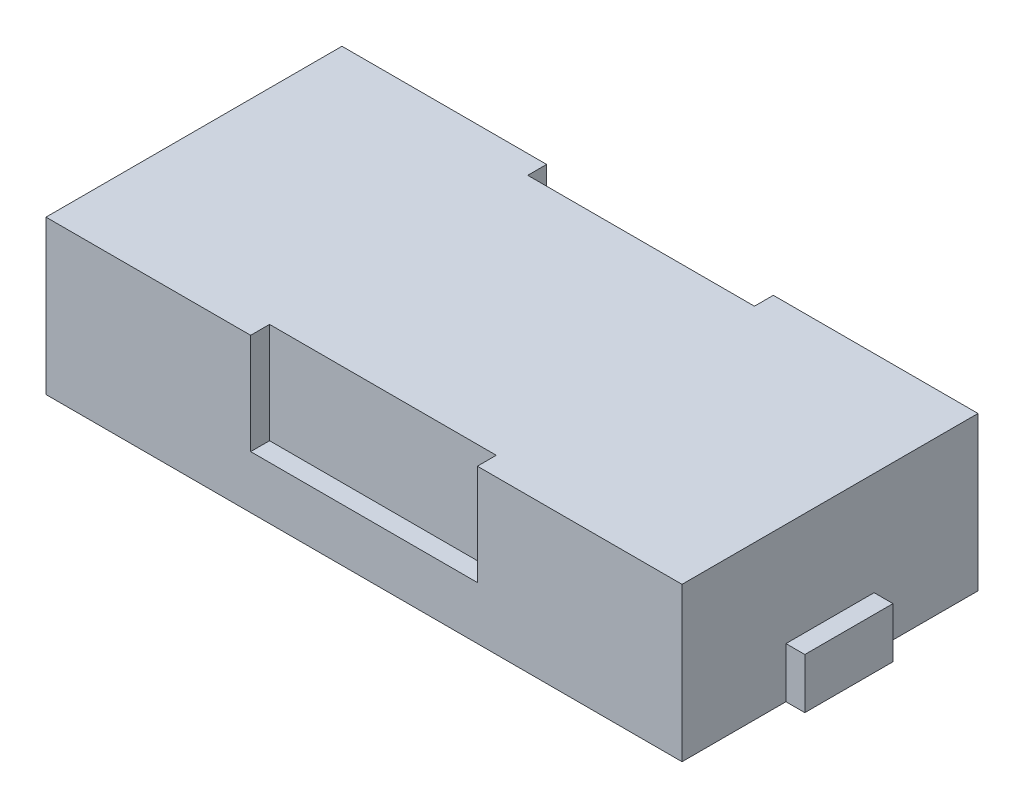
ISO-10303-21;
HEADER;
FILE_DESCRIPTION(('STEP AP214'),'2;1');
FILE_NAME('part.step','',(''),(''),'','','');
FILE_SCHEMA(('AUTOMOTIVE_DESIGN { 1 0 10303 214 1 1 1 1 }'));
ENDSEC;
DATA;
#1=APPLICATION_CONTEXT('core data for automotive mechanical design processes');
#2=APPLICATION_PROTOCOL_DEFINITION('international standard','automotive_design',2000,#1);
#3=PRODUCT_CONTEXT('',#1,'mechanical');
#4=PRODUCT('Part','Part','',(#3));
#5=PRODUCT_RELATED_PRODUCT_CATEGORY('part','',(#4));
#6=PRODUCT_DEFINITION_FORMATION('','',#4);
#7=PRODUCT_DEFINITION_CONTEXT('part definition',#1,'design');
#8=PRODUCT_DEFINITION('design','',#6,#7);
#9=PRODUCT_DEFINITION_SHAPE('','',#8);
#10=(LENGTH_UNIT() NAMED_UNIT(*) SI_UNIT(.MILLI.,.METRE.));
#11=(NAMED_UNIT(*) PLANE_ANGLE_UNIT() SI_UNIT($,.RADIAN.));
#12=(NAMED_UNIT(*) SI_UNIT($,.STERADIAN.) SOLID_ANGLE_UNIT());
#13=UNCERTAINTY_MEASURE_WITH_UNIT(LENGTH_MEASURE(1.E-05),#10,'distance_accuracy_value','');
#14=(GEOMETRIC_REPRESENTATION_CONTEXT(3) GLOBAL_UNCERTAINTY_ASSIGNED_CONTEXT((#13)) GLOBAL_UNIT_ASSIGNED_CONTEXT((#10,
#11,#12)) REPRESENTATION_CONTEXT('',''));
#15=CARTESIAN_POINT('',(0.,0.,0.));
#16=DIRECTION('',(0.,0.,1.));
#17=DIRECTION('',(1.,0.,0.));
#18=AXIS2_PLACEMENT_3D('',#15,#16,#17);
#19=CARTESIAN_POINT('',(-25.25,12.2,-11.75));
#20=DIRECTION('',(0.,0.,1.));
#21=DIRECTION('',(1.,0.,0.));
#22=AXIS2_PLACEMENT_3D('',#19,#20,#21);
#23=PLANE('',#22);
#24=DIRECTION('',(0.,-1.,0.));
#25=VECTOR('',#24,1.);
#26=CARTESIAN_POINT('',(-9.,12.2,-11.75));
#27=LINE('',#26,#25);
#28=CARTESIAN_POINT('',(-9.,12.2,-11.75));
#29=VERTEX_POINT('',#28);
#30=CARTESIAN_POINT('',(-9.,4.2,-11.75));
#31=VERTEX_POINT('',#30);
#32=EDGE_CURVE('E293',#29,#31,#27,.T.);
#33=ORIENTED_EDGE('',*,*,#32,.T.);
#34=DIRECTION('',(1.,0.,0.));
#35=VECTOR('',#34,1.);
#36=CARTESIAN_POINT('',(-9.,4.2,-11.75));
#37=LINE('',#36,#35);
#38=CARTESIAN_POINT('',(9.,4.2,-11.75));
#39=VERTEX_POINT('',#38);
#40=EDGE_CURVE('E294',#31,#39,#37,.T.);
#41=ORIENTED_EDGE('',*,*,#40,.T.);
#42=DIRECTION('',(0.,1.,0.));
#43=VECTOR('',#42,1.);
#44=CARTESIAN_POINT('',(9.,12.2,-11.75));
#45=LINE('',#44,#43);
#46=CARTESIAN_POINT('',(9.,12.2,-11.75));
#47=VERTEX_POINT('',#46);
#48=EDGE_CURVE('E297',#39,#47,#45,.T.);
#49=ORIENTED_EDGE('',*,*,#48,.T.);
#50=DIRECTION('',(-1.,0.,0.));
#51=VECTOR('',#50,1.);
#52=CARTESIAN_POINT('',(-25.25,12.2,-11.75));
#53=LINE('',#52,#51);
#54=CARTESIAN_POINT('',(25.25,12.2,-11.75));
#55=VERTEX_POINT('',#54);
#56=EDGE_CURVE('E169',#55,#47,#53,.T.);
#57=ORIENTED_EDGE('',*,*,#56,.F.);
#58=DIRECTION('',(0.,-1.,0.));
#59=VECTOR('',#58,1.);
#60=CARTESIAN_POINT('',(25.25,12.2,-11.75));
#61=LINE('',#60,#59);
#62=CARTESIAN_POINT('',(25.25,0.,-11.75));
#63=VERTEX_POINT('',#62);
#64=EDGE_CURVE('E11',#55,#63,#61,.T.);
#65=ORIENTED_EDGE('',*,*,#64,.T.);
#66=DIRECTION('',(-1.,0.,0.));
#67=VECTOR('',#66,1.);
#68=CARTESIAN_POINT('',(-25.25,0.,-11.75));
#69=LINE('',#68,#67);
#70=CARTESIAN_POINT('',(-25.25,0.,-11.75));
#71=VERTEX_POINT('',#70);
#72=EDGE_CURVE('E247',#63,#71,#69,.T.);
#73=ORIENTED_EDGE('',*,*,#72,.T.);
#74=DIRECTION('',(0.,-1.,0.));
#75=VECTOR('',#74,1.);
#76=CARTESIAN_POINT('',(-25.25,12.2,-11.75));
#77=LINE('',#76,#75);
#78=CARTESIAN_POINT('',(-25.25,12.2,-11.75));
#79=VERTEX_POINT('',#78);
#80=EDGE_CURVE('E43',#79,#71,#77,.T.);
#81=ORIENTED_EDGE('',*,*,#80,.F.);
#82=EDGE_CURVE('E235',#29,#79,#53,.T.);
#83=ORIENTED_EDGE('',*,*,#82,.F.);
#84=EDGE_LOOP('',(#33,#41,#49,#57,#65,#73,#81,#83));
#85=FACE_BOUND('',#84,.T.);
#86=ADVANCED_FACE('F35',(#85),#23,.F.);
#87=CARTESIAN_POINT('',(0.,12.2,0.));
#88=DIRECTION('',(0.,-1.,0.));
#89=DIRECTION('',(0.,0.,-1.));
#90=AXIS2_PLACEMENT_3D('',#87,#88,#89);
#91=PLANE('',#90);
#92=DIRECTION('',(0.,0.,-1.));
#93=VECTOR('',#92,1.);
#94=CARTESIAN_POINT('',(-9.,12.2,-10.25));
#95=LINE('',#94,#93);
#96=CARTESIAN_POINT('',(-9.,12.2,-10.25));
#97=VERTEX_POINT('',#96);
#98=EDGE_CURVE('E170',#97,#29,#95,.T.);
#99=ORIENTED_EDGE('',*,*,#98,.T.);
#100=ORIENTED_EDGE('',*,*,#82,.T.);
#101=DIRECTION('',(0.,0.,1.));
#102=VECTOR('',#101,1.);
#103=CARTESIAN_POINT('',(-25.25,12.2,11.75));
#104=LINE('',#103,#102);
#105=CARTESIAN_POINT('',(-25.25,12.2,11.75));
#106=VERTEX_POINT('',#105);
#107=EDGE_CURVE('E238',#79,#106,#104,.T.);
#108=ORIENTED_EDGE('',*,*,#107,.T.);
#109=DIRECTION('',(1.,0.,0.));
#110=VECTOR('',#109,1.);
#111=CARTESIAN_POINT('',(-25.25,12.2,11.75));
#112=LINE('',#111,#110);
#113=CARTESIAN_POINT('',(-9.,12.2,11.75));
#114=VERTEX_POINT('',#113);
#115=EDGE_CURVE('E241',#106,#114,#112,.T.);
#116=ORIENTED_EDGE('',*,*,#115,.T.);
#117=DIRECTION('',(0.,0.,1.));
#118=VECTOR('',#117,1.);
#119=CARTESIAN_POINT('',(-9.,12.2,10.25));
#120=LINE('',#119,#118);
#121=CARTESIAN_POINT('',(-9.,12.2,10.25));
#122=VERTEX_POINT('',#121);
#123=EDGE_CURVE('E194',#122,#114,#120,.T.);
#124=ORIENTED_EDGE('',*,*,#123,.F.);
#125=DIRECTION('',(-1.,0.,0.));
#126=VECTOR('',#125,1.);
#127=CARTESIAN_POINT('',(-9.,12.2,10.25));
#128=LINE('',#127,#126);
#129=CARTESIAN_POINT('',(9.,12.2,10.25));
#130=VERTEX_POINT('',#129);
#131=EDGE_CURVE('E184',#130,#122,#128,.T.);
#132=ORIENTED_EDGE('',*,*,#131,.F.);
#133=DIRECTION('',(0.,0.,1.));
#134=VECTOR('',#133,1.);
#135=CARTESIAN_POINT('',(9.,12.2,10.25));
#136=LINE('',#135,#134);
#137=CARTESIAN_POINT('',(9.,12.2,11.75));
#138=VERTEX_POINT('',#137);
#139=EDGE_CURVE('E197',#130,#138,#136,.T.);
#140=ORIENTED_EDGE('',*,*,#139,.T.);
#141=CARTESIAN_POINT('',(25.25,12.2,11.75));
#142=VERTEX_POINT('',#141);
#143=EDGE_CURVE('E240',#138,#142,#112,.T.);
#144=ORIENTED_EDGE('',*,*,#143,.T.);
#145=DIRECTION('',(0.,0.,-1.));
#146=VECTOR('',#145,1.);
#147=CARTESIAN_POINT('',(25.25,12.2,11.75));
#148=LINE('',#147,#146);
#149=EDGE_CURVE('E233',#142,#55,#148,.T.);
#150=ORIENTED_EDGE('',*,*,#149,.T.);
#151=ORIENTED_EDGE('',*,*,#56,.T.);
#152=DIRECTION('',(0.,0.,-1.));
#153=VECTOR('',#152,1.);
#154=CARTESIAN_POINT('',(9.,12.2,-10.25));
#155=LINE('',#154,#153);
#156=CARTESIAN_POINT('',(9.,12.2,-10.25));
#157=VERTEX_POINT('',#156);
#158=EDGE_CURVE('E155',#157,#47,#155,.T.);
#159=ORIENTED_EDGE('',*,*,#158,.F.);
#160=DIRECTION('',(-1.,0.,0.));
#161=VECTOR('',#160,1.);
#162=CARTESIAN_POINT('',(-9.,12.2,-10.25));
#163=LINE('',#162,#161);
#164=EDGE_CURVE('E159',#157,#97,#163,.T.);
#165=ORIENTED_EDGE('',*,*,#164,.T.);
#166=EDGE_LOOP('',(#99,#100,#108,#116,#124,#132,#140,#144,#150,#151,#159,#165));
#167=FACE_BOUND('',#166,.T.);
#168=ADVANCED_FACE('F167',(#167),#91,.F.);
#169=CARTESIAN_POINT('',(25.25,12.2,11.75));
#170=DIRECTION('',(-1.,0.,0.));
#171=DIRECTION('',(0.,0.,1.));
#172=AXIS2_PLACEMENT_3D('',#169,#170,#171);
#173=PLANE('',#172);
#174=DIRECTION('',(0.,-1.,0.));
#175=VECTOR('',#174,1.);
#176=CARTESIAN_POINT('',(25.25,0.,3.5));
#177=LINE('',#176,#175);
#178=CARTESIAN_POINT('',(25.25,4.,3.5));
#179=VERTEX_POINT('',#178);
#180=CARTESIAN_POINT('',(25.25,0.,3.5));
#181=VERTEX_POINT('',#180);
#182=EDGE_CURVE('E196',#179,#181,#177,.T.);
#183=ORIENTED_EDGE('',*,*,#182,.F.);
#184=DIRECTION('',(0.,0.,1.));
#185=VECTOR('',#184,1.);
#186=CARTESIAN_POINT('',(25.25,4.,3.5));
#187=LINE('',#186,#185);
#188=CARTESIAN_POINT('',(25.25,4.,-3.5));
#189=VERTEX_POINT('',#188);
#190=EDGE_CURVE('E207',#189,#179,#187,.T.);
#191=ORIENTED_EDGE('',*,*,#190,.F.);
#192=DIRECTION('',(0.,1.,0.));
#193=VECTOR('',#192,1.);
#194=CARTESIAN_POINT('',(25.25,0.,-3.5));
#195=LINE('',#194,#193);
#196=CARTESIAN_POINT('',(25.25,0.,-3.5));
#197=VERTEX_POINT('',#196);
#198=EDGE_CURVE('E216',#197,#189,#195,.T.);
#199=ORIENTED_EDGE('',*,*,#198,.F.);
#200=DIRECTION('',(0.,0.,-1.));
#201=VECTOR('',#200,1.);
#202=CARTESIAN_POINT('',(25.25,0.,11.75));
#203=LINE('',#202,#201);
#204=EDGE_CURVE('E232',#197,#63,#203,.T.);
#205=ORIENTED_EDGE('',*,*,#204,.T.);
#206=ORIENTED_EDGE('',*,*,#64,.F.);
#207=ORIENTED_EDGE('',*,*,#149,.F.);
#208=DIRECTION('',(0.,-1.,0.));
#209=VECTOR('',#208,1.);
#210=CARTESIAN_POINT('',(25.25,12.2,11.75));
#211=LINE('',#210,#209);
#212=CARTESIAN_POINT('',(25.25,0.,11.75));
#213=VERTEX_POINT('',#212);
#214=EDGE_CURVE('E244',#142,#213,#211,.T.);
#215=ORIENTED_EDGE('',*,*,#214,.T.);
#216=EDGE_CURVE('E245',#213,#181,#203,.T.);
#217=ORIENTED_EDGE('',*,*,#216,.T.);
#218=EDGE_LOOP('',(#183,#191,#199,#205,#206,#207,#215,#217));
#219=FACE_BOUND('',#218,.T.);
#220=ADVANCED_FACE('F37',(#219),#173,.F.);
#221=CARTESIAN_POINT('',(-25.25,12.2,11.75));
#222=DIRECTION('',(1.,0.,0.));
#223=DIRECTION('',(0.,0.,-1.));
#224=AXIS2_PLACEMENT_3D('',#221,#222,#223);
#225=PLANE('',#224);
#226=DIRECTION('',(0.,0.,1.));
#227=VECTOR('',#226,1.);
#228=CARTESIAN_POINT('',(-25.25,0.,11.75));
#229=LINE('',#228,#227);
#230=CARTESIAN_POINT('',(-25.25,0.,11.75));
#231=VERTEX_POINT('',#230);
#232=EDGE_CURVE('E249',#71,#231,#229,.T.);
#233=ORIENTED_EDGE('',*,*,#232,.T.);
#234=DIRECTION('',(0.,-1.,0.));
#235=VECTOR('',#234,1.);
#236=CARTESIAN_POINT('',(-25.25,12.2,11.75));
#237=LINE('',#236,#235);
#238=EDGE_CURVE('E254',#106,#231,#237,.T.);
#239=ORIENTED_EDGE('',*,*,#238,.F.);
#240=ORIENTED_EDGE('',*,*,#107,.F.);
#241=ORIENTED_EDGE('',*,*,#80,.T.);
#242=EDGE_LOOP('',(#233,#239,#240,#241));
#243=FACE_BOUND('',#242,.T.);
#244=ADVANCED_FACE('F261',(#243),#225,.F.);
#245=CARTESIAN_POINT('',(-25.25,12.2,11.75));
#246=DIRECTION('',(0.,0.,-1.));
#247=DIRECTION('',(-1.,0.,0.));
#248=AXIS2_PLACEMENT_3D('',#245,#246,#247);
#249=PLANE('',#248);
#250=DIRECTION('',(1.,0.,0.));
#251=VECTOR('',#250,1.);
#252=CARTESIAN_POINT('',(-9.,4.2,11.75));
#253=LINE('',#252,#251);
#254=CARTESIAN_POINT('',(-9.,4.2,11.75));
#255=VERTEX_POINT('',#254);
#256=CARTESIAN_POINT('',(9.,4.2,11.75));
#257=VERTEX_POINT('',#256);
#258=EDGE_CURVE('E190',#255,#257,#253,.T.);
#259=ORIENTED_EDGE('',*,*,#258,.F.);
#260=DIRECTION('',(0.,-1.,0.));
#261=VECTOR('',#260,1.);
#262=CARTESIAN_POINT('',(-9.,12.2,11.75));
#263=LINE('',#262,#261);
#264=EDGE_CURVE('E187',#114,#255,#263,.T.);
#265=ORIENTED_EDGE('',*,*,#264,.F.);
#266=ORIENTED_EDGE('',*,*,#115,.F.);
#267=ORIENTED_EDGE('',*,*,#238,.T.);
#268=DIRECTION('',(1.,0.,0.));
#269=VECTOR('',#268,1.);
#270=CARTESIAN_POINT('',(-25.25,0.,11.75));
#271=LINE('',#270,#269);
#272=EDGE_CURVE('E236',#231,#213,#271,.T.);
#273=ORIENTED_EDGE('',*,*,#272,.T.);
#274=ORIENTED_EDGE('',*,*,#214,.F.);
#275=ORIENTED_EDGE('',*,*,#143,.F.);
#276=DIRECTION('',(0.,1.,0.));
#277=VECTOR('',#276,1.);
#278=CARTESIAN_POINT('',(9.,12.2,11.75));
#279=LINE('',#278,#277);
#280=EDGE_CURVE('E181',#257,#138,#279,.T.);
#281=ORIENTED_EDGE('',*,*,#280,.F.);
#282=EDGE_LOOP('',(#259,#265,#266,#267,#273,#274,#275,#281));
#283=FACE_BOUND('',#282,.T.);
#284=ADVANCED_FACE('F274',(#283),#249,.F.);
#285=CARTESIAN_POINT('',(0.,0.,0.));
#286=DIRECTION('',(0.,-1.,0.));
#287=DIRECTION('',(0.,0.,-1.));
#288=AXIS2_PLACEMENT_3D('',#285,#286,#287);
#289=PLANE('',#288);
#290=ORIENTED_EDGE('',*,*,#216,.F.);
#291=ORIENTED_EDGE('',*,*,#272,.F.);
#292=ORIENTED_EDGE('',*,*,#232,.F.);
#293=ORIENTED_EDGE('',*,*,#72,.F.);
#294=ORIENTED_EDGE('',*,*,#204,.F.);
#295=DIRECTION('',(-1.,0.,0.));
#296=VECTOR('',#295,1.);
#297=CARTESIAN_POINT('',(26.75,0.,-3.5));
#298=LINE('',#297,#296);
#299=CARTESIAN_POINT('',(26.75,0.,-3.5));
#300=VERTEX_POINT('',#299);
#301=EDGE_CURVE('E226',#300,#197,#298,.T.);
#302=ORIENTED_EDGE('',*,*,#301,.F.);
#303=DIRECTION('',(0.,0.,-1.));
#304=VECTOR('',#303,1.);
#305=CARTESIAN_POINT('',(26.75,0.,3.5));
#306=LINE('',#305,#304);
#307=CARTESIAN_POINT('',(26.75,0.,3.5));
#308=VERTEX_POINT('',#307);
#309=EDGE_CURVE('E206',#308,#300,#306,.T.);
#310=ORIENTED_EDGE('',*,*,#309,.F.);
#311=DIRECTION('',(-1.,0.,0.));
#312=VECTOR('',#311,1.);
#313=CARTESIAN_POINT('',(26.75,0.,3.5));
#314=LINE('',#313,#312);
#315=EDGE_CURVE('E229',#308,#181,#314,.T.);
#316=ORIENTED_EDGE('',*,*,#315,.T.);
#317=EDGE_LOOP('',(#290,#291,#292,#293,#294,#302,#310,#316));
#318=FACE_BOUND('',#317,.T.);
#319=ADVANCED_FACE('F269',(#318),#289,.T.);
#320=CARTESIAN_POINT('',(26.75,0.,3.5));
#321=DIRECTION('',(0.,0.,-1.));
#322=DIRECTION('',(0.,1.,0.));
#323=AXIS2_PLACEMENT_3D('',#320,#321,#322);
#324=PLANE('',#323);
#325=ORIENTED_EDGE('',*,*,#182,.T.);
#326=ORIENTED_EDGE('',*,*,#315,.F.);
#327=DIRECTION('',(0.,-1.,0.));
#328=VECTOR('',#327,1.);
#329=CARTESIAN_POINT('',(26.75,0.,3.5));
#330=LINE('',#329,#328);
#331=CARTESIAN_POINT('',(26.75,4.,3.5));
#332=VERTEX_POINT('',#331);
#333=EDGE_CURVE('E203',#332,#308,#330,.T.);
#334=ORIENTED_EDGE('',*,*,#333,.F.);
#335=DIRECTION('',(-1.,0.,0.));
#336=VECTOR('',#335,1.);
#337=CARTESIAN_POINT('',(26.75,4.,3.5));
#338=LINE('',#337,#336);
#339=EDGE_CURVE('E213',#332,#179,#338,.T.);
#340=ORIENTED_EDGE('',*,*,#339,.T.);
#341=EDGE_LOOP('',(#325,#326,#334,#340));
#342=FACE_BOUND('',#341,.T.);
#343=ADVANCED_FACE('F327',(#342),#324,.F.);
#344=CARTESIAN_POINT('',(26.75,0.,-3.5));
#345=DIRECTION('',(0.,0.,1.));
#346=DIRECTION('',(0.,-1.,0.));
#347=AXIS2_PLACEMENT_3D('',#344,#345,#346);
#348=PLANE('',#347);
#349=ORIENTED_EDGE('',*,*,#198,.T.);
#350=DIRECTION('',(-1.,0.,0.));
#351=VECTOR('',#350,1.);
#352=CARTESIAN_POINT('',(26.75,4.,-3.5));
#353=LINE('',#352,#351);
#354=CARTESIAN_POINT('',(26.75,4.,-3.5));
#355=VERTEX_POINT('',#354);
#356=EDGE_CURVE('E223',#355,#189,#353,.T.);
#357=ORIENTED_EDGE('',*,*,#356,.F.);
#358=DIRECTION('',(0.,1.,0.));
#359=VECTOR('',#358,1.);
#360=CARTESIAN_POINT('',(26.75,0.,-3.5));
#361=LINE('',#360,#359);
#362=EDGE_CURVE('E209',#300,#355,#361,.T.);
#363=ORIENTED_EDGE('',*,*,#362,.F.);
#364=ORIENTED_EDGE('',*,*,#301,.T.);
#365=EDGE_LOOP('',(#349,#357,#363,#364));
#366=FACE_BOUND('',#365,.T.);
#367=ADVANCED_FACE('F331',(#366),#348,.F.);
#368=CARTESIAN_POINT('',(26.75,4.,3.5));
#369=DIRECTION('',(0.,-1.,0.));
#370=DIRECTION('',(0.,0.,-1.));
#371=AXIS2_PLACEMENT_3D('',#368,#369,#370);
#372=PLANE('',#371);
#373=ORIENTED_EDGE('',*,*,#190,.T.);
#374=ORIENTED_EDGE('',*,*,#339,.F.);
#375=DIRECTION('',(0.,0.,1.));
#376=VECTOR('',#375,1.);
#377=CARTESIAN_POINT('',(26.75,4.,3.5));
#378=LINE('',#377,#376);
#379=EDGE_CURVE('E211',#355,#332,#378,.T.);
#380=ORIENTED_EDGE('',*,*,#379,.F.);
#381=ORIENTED_EDGE('',*,*,#356,.T.);
#382=EDGE_LOOP('',(#373,#374,#380,#381));
#383=FACE_BOUND('',#382,.T.);
#384=ADVANCED_FACE('F335',(#383),#372,.F.);
#385=CARTESIAN_POINT('',(26.75,0.,0.));
#386=DIRECTION('',(-1.,0.,0.));
#387=DIRECTION('',(0.,0.,1.));
#388=AXIS2_PLACEMENT_3D('',#385,#386,#387);
#389=PLANE('',#388);
#390=ORIENTED_EDGE('',*,*,#333,.T.);
#391=ORIENTED_EDGE('',*,*,#309,.T.);
#392=ORIENTED_EDGE('',*,*,#362,.T.);
#393=ORIENTED_EDGE('',*,*,#379,.T.);
#394=EDGE_LOOP('',(#390,#391,#392,#393));
#395=FACE_BOUND('',#394,.T.);
#396=ADVANCED_FACE('F339',(#395),#389,.F.);
#397=CARTESIAN_POINT('',(-9.,12.2,10.25));
#398=DIRECTION('',(-1.,0.,0.));
#399=DIRECTION('',(0.,-1.,0.));
#400=AXIS2_PLACEMENT_3D('',#397,#398,#399);
#401=PLANE('',#400);
#402=ORIENTED_EDGE('',*,*,#264,.T.);
#403=DIRECTION('',(0.,0.,1.));
#404=VECTOR('',#403,1.);
#405=CARTESIAN_POINT('',(-9.,4.2,10.25));
#406=LINE('',#405,#404);
#407=CARTESIAN_POINT('',(-9.,4.2,10.25));
#408=VERTEX_POINT('',#407);
#409=EDGE_CURVE('E186',#408,#255,#406,.T.);
#410=ORIENTED_EDGE('',*,*,#409,.F.);
#411=DIRECTION('',(0.,-1.,0.));
#412=VECTOR('',#411,1.);
#413=CARTESIAN_POINT('',(-9.,12.2,10.25));
#414=LINE('',#413,#412);
#415=EDGE_CURVE('E177',#122,#408,#414,.T.);
#416=ORIENTED_EDGE('',*,*,#415,.F.);
#417=ORIENTED_EDGE('',*,*,#123,.T.);
#418=EDGE_LOOP('',(#402,#410,#416,#417));
#419=FACE_BOUND('',#418,.T.);
#420=ADVANCED_FACE('F289',(#419),#401,.F.);
#421=CARTESIAN_POINT('',(9.,12.2,10.25));
#422=DIRECTION('',(1.,0.,0.));
#423=DIRECTION('',(0.,1.,0.));
#424=AXIS2_PLACEMENT_3D('',#421,#422,#423);
#425=PLANE('',#424);
#426=ORIENTED_EDGE('',*,*,#280,.T.);
#427=ORIENTED_EDGE('',*,*,#139,.F.);
#428=DIRECTION('',(0.,1.,0.));
#429=VECTOR('',#428,1.);
#430=CARTESIAN_POINT('',(9.,12.2,10.25));
#431=LINE('',#430,#429);
#432=CARTESIAN_POINT('',(9.,4.2,10.25));
#433=VERTEX_POINT('',#432);
#434=EDGE_CURVE('E58',#433,#130,#431,.T.);
#435=ORIENTED_EDGE('',*,*,#434,.F.);
#436=DIRECTION('',(0.,0.,1.));
#437=VECTOR('',#436,1.);
#438=CARTESIAN_POINT('',(9.,4.2,10.25));
#439=LINE('',#438,#437);
#440=EDGE_CURVE('E200',#433,#257,#439,.T.);
#441=ORIENTED_EDGE('',*,*,#440,.T.);
#442=EDGE_LOOP('',(#426,#427,#435,#441));
#443=FACE_BOUND('',#442,.T.);
#444=ADVANCED_FACE('F284',(#443),#425,.F.);
#445=CARTESIAN_POINT('',(-9.,4.2,10.25));
#446=DIRECTION('',(0.,-1.,0.));
#447=DIRECTION('',(0.,0.,-1.));
#448=AXIS2_PLACEMENT_3D('',#445,#446,#447);
#449=PLANE('',#448);
#450=ORIENTED_EDGE('',*,*,#258,.T.);
#451=ORIENTED_EDGE('',*,*,#440,.F.);
#452=DIRECTION('',(1.,0.,0.));
#453=VECTOR('',#452,1.);
#454=CARTESIAN_POINT('',(-9.,4.2,10.25));
#455=LINE('',#454,#453);
#456=EDGE_CURVE('E180',#408,#433,#455,.T.);
#457=ORIENTED_EDGE('',*,*,#456,.F.);
#458=ORIENTED_EDGE('',*,*,#409,.T.);
#459=EDGE_LOOP('',(#450,#451,#457,#458));
#460=FACE_BOUND('',#459,.T.);
#461=ADVANCED_FACE('F287',(#460),#449,.F.);
#462=CARTESIAN_POINT('',(0.,0.,10.25));
#463=DIRECTION('',(0.,0.,1.));
#464=DIRECTION('',(1.,0.,0.));
#465=AXIS2_PLACEMENT_3D('',#462,#463,#464);
#466=PLANE('',#465);
#467=ORIENTED_EDGE('',*,*,#415,.T.);
#468=ORIENTED_EDGE('',*,*,#456,.T.);
#469=ORIENTED_EDGE('',*,*,#434,.T.);
#470=ORIENTED_EDGE('',*,*,#131,.T.);
#471=EDGE_LOOP('',(#467,#468,#469,#470));
#472=FACE_BOUND('',#471,.T.);
#473=ADVANCED_FACE('F313',(#472),#466,.T.);
#474=CARTESIAN_POINT('',(-9.,12.2,-10.25));
#475=DIRECTION('',(1.,0.,0.));
#476=DIRECTION('',(0.,1.,0.));
#477=AXIS2_PLACEMENT_3D('',#474,#475,#476);
#478=PLANE('',#477);
#479=ORIENTED_EDGE('',*,*,#32,.F.);
#480=ORIENTED_EDGE('',*,*,#98,.F.);
#481=DIRECTION('',(0.,-1.,0.));
#482=VECTOR('',#481,1.);
#483=CARTESIAN_POINT('',(-9.,12.2,-10.25));
#484=LINE('',#483,#482);
#485=CARTESIAN_POINT('',(-9.,4.2,-10.25));
#486=VERTEX_POINT('',#485);
#487=EDGE_CURVE('E50',#97,#486,#484,.T.);
#488=ORIENTED_EDGE('',*,*,#487,.T.);
#489=DIRECTION('',(0.,0.,-1.));
#490=VECTOR('',#489,1.);
#491=CARTESIAN_POINT('',(-9.,4.2,-10.25));
#492=LINE('',#491,#490);
#493=EDGE_CURVE('E172',#486,#31,#492,.T.);
#494=ORIENTED_EDGE('',*,*,#493,.T.);
#495=EDGE_LOOP('',(#479,#480,#488,#494));
#496=FACE_BOUND('',#495,.T.);
#497=ADVANCED_FACE('F303',(#496),#478,.T.);
#498=CARTESIAN_POINT('',(-9.,4.2,-10.25));
#499=DIRECTION('',(0.,1.,0.));
#500=DIRECTION('',(0.,0.,1.));
#501=AXIS2_PLACEMENT_3D('',#498,#499,#500);
#502=PLANE('',#501);
#503=ORIENTED_EDGE('',*,*,#40,.F.);
#504=ORIENTED_EDGE('',*,*,#493,.F.);
#505=DIRECTION('',(1.,0.,0.));
#506=VECTOR('',#505,1.);
#507=CARTESIAN_POINT('',(-9.,4.2,-10.25));
#508=LINE('',#507,#506);
#509=CARTESIAN_POINT('',(9.,4.2,-10.25));
#510=VERTEX_POINT('',#509);
#511=EDGE_CURVE('E158',#486,#510,#508,.T.);
#512=ORIENTED_EDGE('',*,*,#511,.T.);
#513=DIRECTION('',(0.,0.,-1.));
#514=VECTOR('',#513,1.);
#515=CARTESIAN_POINT('',(9.,4.2,-10.25));
#516=LINE('',#515,#514);
#517=EDGE_CURVE('E157',#510,#39,#516,.T.);
#518=ORIENTED_EDGE('',*,*,#517,.T.);
#519=EDGE_LOOP('',(#503,#504,#512,#518));
#520=FACE_BOUND('',#519,.T.);
#521=ADVANCED_FACE('F305',(#520),#502,.T.);
#522=CARTESIAN_POINT('',(9.,12.2,-10.25));
#523=DIRECTION('',(-1.,0.,0.));
#524=DIRECTION('',(0.,-1.,0.));
#525=AXIS2_PLACEMENT_3D('',#522,#523,#524);
#526=PLANE('',#525);
#527=ORIENTED_EDGE('',*,*,#48,.F.);
#528=ORIENTED_EDGE('',*,*,#517,.F.);
#529=DIRECTION('',(0.,1.,0.));
#530=VECTOR('',#529,1.);
#531=CARTESIAN_POINT('',(9.,12.2,-10.25));
#532=LINE('',#531,#530);
#533=EDGE_CURVE('E151',#510,#157,#532,.T.);
#534=ORIENTED_EDGE('',*,*,#533,.T.);
#535=ORIENTED_EDGE('',*,*,#158,.T.);
#536=EDGE_LOOP('',(#527,#528,#534,#535));
#537=FACE_BOUND('',#536,.T.);
#538=ADVANCED_FACE('F153',(#537),#526,.T.);
#539=CARTESIAN_POINT('',(0.,0.,-10.25));
#540=DIRECTION('',(0.,0.,-1.));
#541=DIRECTION('',(1.,0.,0.));
#542=AXIS2_PLACEMENT_3D('',#539,#540,#541);
#543=PLANE('',#542);
#544=ORIENTED_EDGE('',*,*,#487,.F.);
#545=ORIENTED_EDGE('',*,*,#164,.F.);
#546=ORIENTED_EDGE('',*,*,#533,.F.);
#547=ORIENTED_EDGE('',*,*,#511,.F.);
#548=EDGE_LOOP('',(#544,#545,#546,#547));
#549=FACE_BOUND('',#548,.T.);
#550=ADVANCED_FACE('F162',(#549),#543,.T.);
#551=CLOSED_SHELL('',(#86,#168,#220,#244,#284,#319,#343,#367,#384,#396,#420,#444,#461,#473,#497,
#521,#538,#550));
#552=MANIFOLD_SOLID_BREP('B2',#551);
#553=ADVANCED_BREP_SHAPE_REPRESENTATION('',(#18,#552),#14);
#554=SHAPE_DEFINITION_REPRESENTATION(#9,#553);
ENDSEC;
END-ISO-10303-21;
